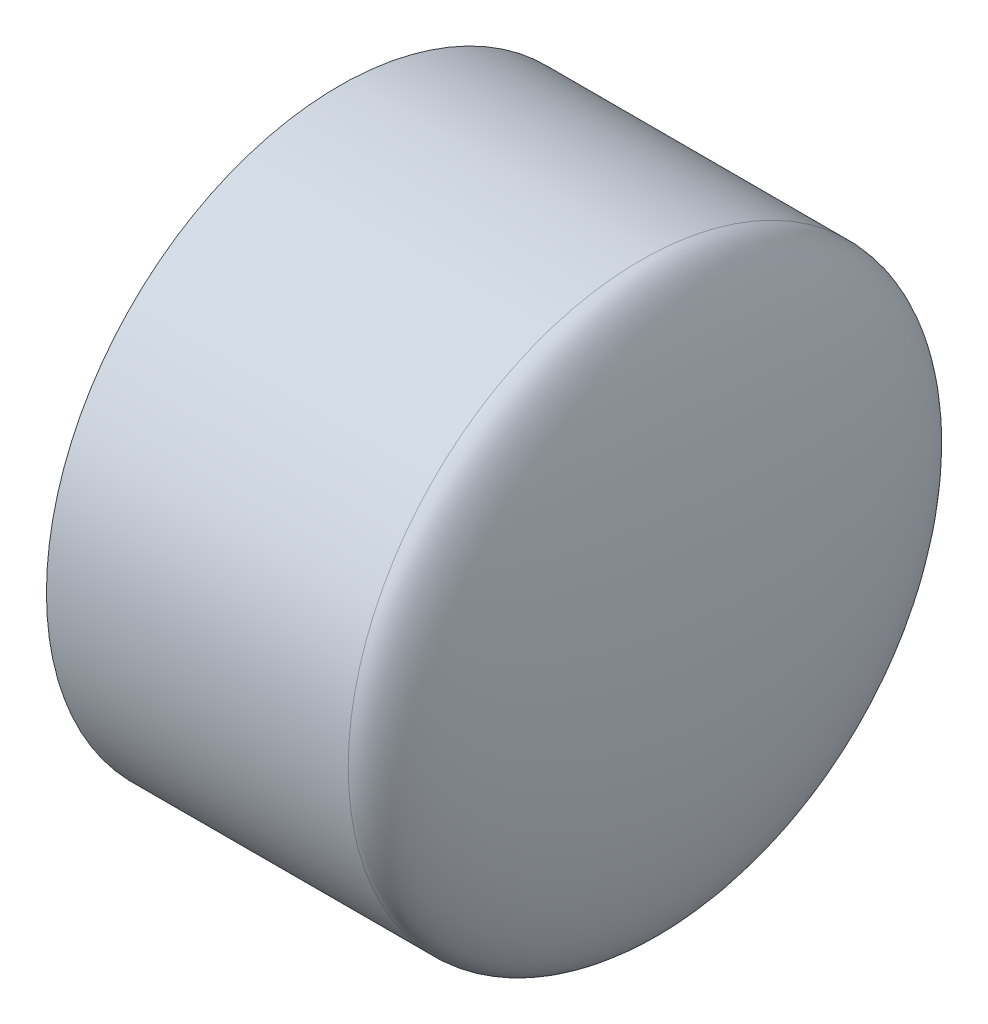
ISO-10303-21;
HEADER;
FILE_DESCRIPTION(('STEP AP214'),'2;1');
FILE_NAME('part.step','',(''),(''),'','','');
FILE_SCHEMA(('AUTOMOTIVE_DESIGN { 1 0 10303 214 1 1 1 1 }'));
ENDSEC;
DATA;
#1=APPLICATION_CONTEXT('core data for automotive mechanical design processes');
#2=APPLICATION_PROTOCOL_DEFINITION('international standard','automotive_design',2000,#1);
#3=PRODUCT_CONTEXT('',#1,'mechanical');
#4=PRODUCT('Part','Part','',(#3));
#5=PRODUCT_RELATED_PRODUCT_CATEGORY('part','',(#4));
#6=PRODUCT_DEFINITION_FORMATION('','',#4);
#7=PRODUCT_DEFINITION_CONTEXT('part definition',#1,'design');
#8=PRODUCT_DEFINITION('design','',#6,#7);
#9=PRODUCT_DEFINITION_SHAPE('','',#8);
#10=(LENGTH_UNIT() NAMED_UNIT(*) SI_UNIT(.MILLI.,.METRE.));
#11=(NAMED_UNIT(*) PLANE_ANGLE_UNIT() SI_UNIT($,.RADIAN.));
#12=(NAMED_UNIT(*) SI_UNIT($,.STERADIAN.) SOLID_ANGLE_UNIT());
#13=UNCERTAINTY_MEASURE_WITH_UNIT(LENGTH_MEASURE(1.E-05),#10,'distance_accuracy_value','');
#14=(GEOMETRIC_REPRESENTATION_CONTEXT(3) GLOBAL_UNCERTAINTY_ASSIGNED_CONTEXT((#13)) GLOBAL_UNIT_ASSIGNED_CONTEXT((#10,
#11,#12)) REPRESENTATION_CONTEXT('',''));
#15=CARTESIAN_POINT('',(0.,0.,0.));
#16=DIRECTION('',(0.,0.,1.));
#17=DIRECTION('',(1.,0.,0.));
#18=AXIS2_PLACEMENT_3D('',#15,#16,#17);
#19=CARTESIAN_POINT('',(-80.9625,-63.896875,0.));
#20=DIRECTION('',(-1.,0.,0.));
#21=DIRECTION('',(0.,0.,1.));
#22=AXIS2_PLACEMENT_3D('',#19,#20,#21);
#23=PLANE('',#22);
#24=CARTESIAN_POINT('',(-80.9625,0.,0.));
#25=DIRECTION('',(-1.,0.,0.));
#26=DIRECTION('',(0.,0.,1.));
#27=AXIS2_PLACEMENT_3D('',#24,#25,#26);
#28=CIRCLE('',#27,63.896875);
#29=CARTESIAN_POINT('',(-80.9625,0.,63.896875));
#30=VERTEX_POINT('',#29);
#31=EDGE_CURVE('E11',#30,#30,#28,.T.);
#32=ORIENTED_EDGE('',*,*,#31,.T.);
#33=EDGE_LOOP('',(#32));
#34=FACE_BOUND('',#33,.T.);
#35=CARTESIAN_POINT('',(-80.9625,0.,0.));
#36=DIRECTION('',(-1.,0.,0.));
#37=DIRECTION('',(0.,0.,1.));
#38=AXIS2_PLACEMENT_3D('',#35,#36,#37);
#39=CIRCLE('',#38,57.3786);
#40=CARTESIAN_POINT('',(-80.9625,0.,57.3786));
#41=VERTEX_POINT('',#40);
#42=EDGE_CURVE('E56',#41,#41,#39,.T.);
#43=ORIENTED_EDGE('',*,*,#42,.F.);
#44=EDGE_LOOP('',(#43));
#45=FACE_BOUND('',#44,.T.);
#46=ADVANCED_FACE('F32',(#34,#45),#23,.T.);
#47=CARTESIAN_POINT('',(-80.9625,0.,0.));
#48=DIRECTION('',(-1.,0.,0.));
#49=DIRECTION('',(0.,0.,1.));
#50=AXIS2_PLACEMENT_3D('',#47,#48,#49);
#51=CYLINDRICAL_SURFACE('',#50,63.896875);
#52=CARTESIAN_POINT('',(-15.08125,0.,0.));
#53=DIRECTION('',(-1.,0.,0.));
#54=DIRECTION('',(0.,0.,1.));
#55=AXIS2_PLACEMENT_3D('',#52,#53,#54);
#56=CIRCLE('',#55,63.896875);
#57=CARTESIAN_POINT('',(-15.08125,0.,63.896875));
#58=VERTEX_POINT('',#57);
#59=EDGE_CURVE('E39',#58,#58,#56,.T.);
#60=ORIENTED_EDGE('',*,*,#59,.T.);
#61=EDGE_LOOP('',(#60));
#62=FACE_BOUND('',#61,.T.);
#63=ORIENTED_EDGE('',*,*,#31,.F.);
#64=EDGE_LOOP('',(#63));
#65=FACE_BOUND('',#64,.T.);
#66=ADVANCED_FACE('F49',(#62,#65),#51,.T.);
#67=CARTESIAN_POINT('',(-15.08125,0.,0.));
#68=DIRECTION('',(0.,0.,1.));
#69=DIRECTION('',(0.,-1.,0.));
#70=AXIS2_PLACEMENT_3D('',#67,#68,#69);
#71=ELLIPSE('',#70,63.896875,15.08125);
#72=TRIMMED_CURVE('',#71,(PARAMETER_VALUE(-1.5707963267949)),(PARAMETER_VALUE(1.5707963267949)),
.T.,.PARAMETER.);
#73=CARTESIAN_POINT('',(-80.9625,0.,0.));
#74=DIRECTION('',(-1.,0.,0.));
#75=AXIS1_PLACEMENT('',#73,#74);
#76=SURFACE_OF_REVOLUTION('',#72,#75);
#77=CARTESIAN_POINT('',(0.,0.,0.));
#78=VERTEX_POINT('',#77);
#79=VERTEX_LOOP('',#78);
#80=FACE_BOUND('',#79,.T.);
#81=ORIENTED_EDGE('',*,*,#59,.F.);
#82=EDGE_LOOP('',(#81));
#83=FACE_BOUND('',#82,.T.);
#84=ADVANCED_FACE('F45',(#80,#83),#76,.F.);
#85=CARTESIAN_POINT('',(-30.1625,0.,0.));
#86=DIRECTION('',(0.,0.,-1.));
#87=DIRECTION('',(0.,-1.,0.));
#88=AXIS2_PLACEMENT_3D('',#85,#86,#87);
#89=ELLIPSE('',#88,57.0357,15.08125);
#90=TRIMMED_CURVE('',#89,(PARAMETER_VALUE(4.71238898038469)),
(PARAMETER_VALUE(7.85398163397448)),.T.,.PARAMETER.);
#91=CARTESIAN_POINT('',(-80.9625,0.,0.));
#92=DIRECTION('',(-1.,0.,0.));
#93=AXIS1_PLACEMENT('',#91,#92);
#94=SURFACE_OF_REVOLUTION('',#90,#93);
#95=CARTESIAN_POINT('',(-30.1625,0.,0.));
#96=DIRECTION('',(-1.,0.,0.));
#97=DIRECTION('',(0.,0.,1.));
#98=AXIS2_PLACEMENT_3D('',#95,#96,#97);
#99=CIRCLE('',#98,57.0357);
#100=CARTESIAN_POINT('',(-30.1625,0.,57.0357));
#101=VERTEX_POINT('',#100);
#102=EDGE_CURVE('E54',#101,#101,#99,.T.);
#103=ORIENTED_EDGE('',*,*,#102,.T.);
#104=EDGE_LOOP('',(#103));
#105=FACE_BOUND('',#104,.T.);
#106=CARTESIAN_POINT('',(-15.08125,0.,0.));
#107=VERTEX_POINT('',#106);
#108=VERTEX_LOOP('',#107);
#109=FACE_BOUND('',#108,.T.);
#110=ADVANCED_FACE('F48',(#105,#109),#94,.F.);
#111=CARTESIAN_POINT('',(-30.1625,0.,0.));
#112=DIRECTION('',(-1.,0.,0.));
#113=DIRECTION('',(0.,0.,1.));
#114=AXIS2_PLACEMENT_3D('',#111,#112,#113);
#115=CONICAL_SURFACE('',#114,57.0357,0.00674989748717744);
#116=ORIENTED_EDGE('',*,*,#42,.T.);
#117=EDGE_LOOP('',(#116));
#118=FACE_BOUND('',#117,.T.);
#119=ORIENTED_EDGE('',*,*,#102,.F.);
#120=EDGE_LOOP('',(#119));
#121=FACE_BOUND('',#120,.T.);
#122=ADVANCED_FACE('F67',(#118,#121),#115,.F.);
#123=CLOSED_SHELL('',(#46,#66,#84,#110,#122));
#124=MANIFOLD_SOLID_BREP('B2',#123);
#125=ADVANCED_BREP_SHAPE_REPRESENTATION('',(#18,#124),#14);
#126=SHAPE_DEFINITION_REPRESENTATION(#9,#125);
ENDSEC;
END-ISO-10303-21;
